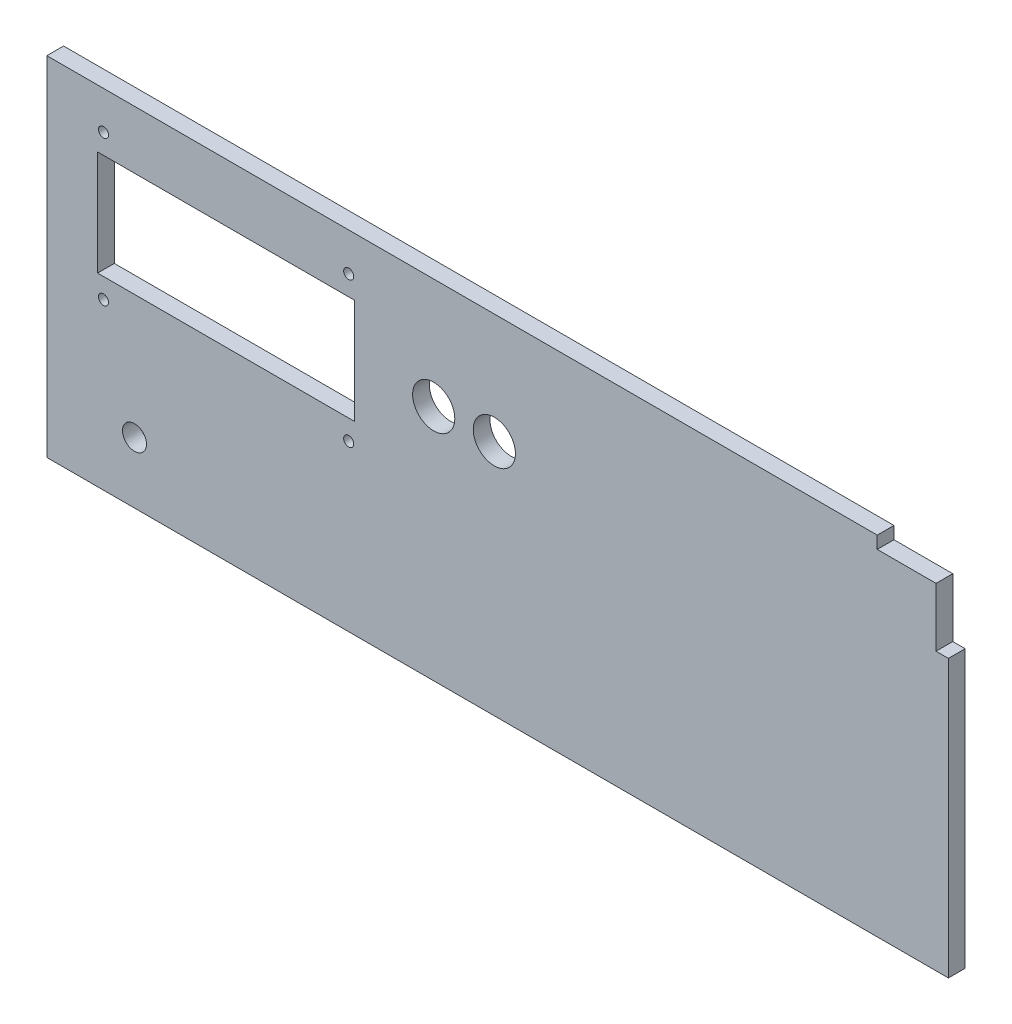
ISO-10303-21;
HEADER;
FILE_DESCRIPTION(('STEP AP214'),'2;1');
FILE_NAME('part.step','',(''),(''),'','','');
FILE_SCHEMA(('AUTOMOTIVE_DESIGN { 1 0 10303 214 1 1 1 1 }'));
ENDSEC;
DATA;
#1=APPLICATION_CONTEXT('core data for automotive mechanical design processes');
#2=APPLICATION_PROTOCOL_DEFINITION('international standard','automotive_design',2000,#1);
#3=PRODUCT_CONTEXT('',#1,'mechanical');
#4=PRODUCT('Part','Part','',(#3));
#5=PRODUCT_RELATED_PRODUCT_CATEGORY('part','',(#4));
#6=PRODUCT_DEFINITION_FORMATION('','',#4);
#7=PRODUCT_DEFINITION_CONTEXT('part definition',#1,'design');
#8=PRODUCT_DEFINITION('design','',#6,#7);
#9=PRODUCT_DEFINITION_SHAPE('','',#8);
#10=(LENGTH_UNIT() NAMED_UNIT(*) SI_UNIT(.MILLI.,.METRE.));
#11=(NAMED_UNIT(*) PLANE_ANGLE_UNIT() SI_UNIT($,.RADIAN.));
#12=(NAMED_UNIT(*) SI_UNIT($,.STERADIAN.) SOLID_ANGLE_UNIT());
#13=UNCERTAINTY_MEASURE_WITH_UNIT(LENGTH_MEASURE(1.E-05),#10,'distance_accuracy_value','');
#14=(GEOMETRIC_REPRESENTATION_CONTEXT(3) GLOBAL_UNCERTAINTY_ASSIGNED_CONTEXT((#13)) GLOBAL_UNIT_ASSIGNED_CONTEXT((#10,
#11,#12)) REPRESENTATION_CONTEXT('',''));
#15=CARTESIAN_POINT('',(0.,0.,0.));
#16=DIRECTION('',(0.,0.,1.));
#17=DIRECTION('',(1.,0.,0.));
#18=AXIS2_PLACEMENT_3D('',#15,#16,#17);
#19=CARTESIAN_POINT('',(0.,0.,6.35));
#20=DIRECTION('',(0.,0.,-1.));
#21=DIRECTION('',(-1.,0.,0.));
#22=AXIS2_PLACEMENT_3D('',#19,#20,#21);
#23=PLANE('',#22);
#24=CARTESIAN_POINT('',(146.75,90.1,6.35));
#25=DIRECTION('',(0.,0.,1.));
#26=DIRECTION('',(1.,0.,0.));
#27=AXIS2_PLACEMENT_3D('',#24,#25,#26);
#28=CIRCLE('',#27,8.00000000000001);
#29=CARTESIAN_POINT('',(154.75,90.1,6.35));
#30=VERTEX_POINT('',#29);
#31=EDGE_CURVE('E161',#30,#30,#28,.T.);
#32=ORIENTED_EDGE('',*,*,#31,.F.);
#33=EDGE_LOOP('',(#32));
#34=FACE_BOUND('',#33,.T.);
#35=CARTESIAN_POINT('',(169.75,90.1,6.35));
#36=DIRECTION('',(0.,0.,1.));
#37=DIRECTION('',(1.,0.,0.));
#38=AXIS2_PLACEMENT_3D('',#35,#36,#37);
#39=CIRCLE('',#38,8.00000000000001);
#40=CARTESIAN_POINT('',(177.75,90.1,6.35));
#41=VERTEX_POINT('',#40);
#42=EDGE_CURVE('E167',#41,#41,#39,.T.);
#43=ORIENTED_EDGE('',*,*,#42,.F.);
#44=EDGE_LOOP('',(#43));
#45=FACE_BOUND('',#44,.T.);
#46=CARTESIAN_POINT('',(21.4999951210496,117.600002885401,6.35));
#47=DIRECTION('',(0.,0.,1.));
#48=DIRECTION('',(1.,0.,0.));
#49=AXIS2_PLACEMENT_3D('',#46,#47,#48);
#50=CIRCLE('',#49,1.9);
#51=CARTESIAN_POINT('',(23.3999951210496,117.600002885401,6.35));
#52=VERTEX_POINT('',#51);
#53=EDGE_CURVE('E173',#52,#52,#50,.T.);
#54=ORIENTED_EDGE('',*,*,#53,.F.);
#55=EDGE_LOOP('',(#54));
#56=FACE_BOUND('',#55,.T.);
#57=CARTESIAN_POINT('',(21.4999951210496,62.6,6.35));
#58=DIRECTION('',(0.,0.,1.));
#59=DIRECTION('',(1.,0.,0.));
#60=AXIS2_PLACEMENT_3D('',#57,#58,#59);
#61=CIRCLE('',#60,1.9);
#62=CARTESIAN_POINT('',(23.3999951210496,62.6,6.35));
#63=VERTEX_POINT('',#62);
#64=EDGE_CURVE('E179',#63,#63,#61,.T.);
#65=ORIENTED_EDGE('',*,*,#64,.F.);
#66=EDGE_LOOP('',(#65));
#67=FACE_BOUND('',#66,.T.);
#68=CARTESIAN_POINT('',(114.49999512105,62.6,6.35));
#69=DIRECTION('',(0.,0.,1.));
#70=DIRECTION('',(1.,0.,0.));
#71=AXIS2_PLACEMENT_3D('',#68,#69,#70);
#72=CIRCLE('',#71,1.9);
#73=CARTESIAN_POINT('',(116.39999512105,62.6,6.35));
#74=VERTEX_POINT('',#73);
#75=EDGE_CURVE('E185',#74,#74,#72,.T.);
#76=ORIENTED_EDGE('',*,*,#75,.F.);
#77=EDGE_LOOP('',(#76));
#78=FACE_BOUND('',#77,.T.);
#79=CARTESIAN_POINT('',(114.49999512105,117.600002885401,6.35));
#80=DIRECTION('',(0.,0.,1.));
#81=DIRECTION('',(1.,0.,0.));
#82=AXIS2_PLACEMENT_3D('',#79,#80,#81);
#83=CIRCLE('',#82,1.9);
#84=CARTESIAN_POINT('',(116.39999512105,117.600002885401,6.35));
#85=VERTEX_POINT('',#84);
#86=EDGE_CURVE('E191',#85,#85,#83,.T.);
#87=ORIENTED_EDGE('',*,*,#86,.F.);
#88=EDGE_LOOP('',(#87));
#89=FACE_BOUND('',#88,.T.);
#90=DIRECTION('',(0.,-1.,0.));
#91=VECTOR('',#90,1.);
#92=CARTESIAN_POINT('',(0.,0.,6.35));
#93=LINE('',#92,#91);
#94=CARTESIAN_POINT('',(0.,132.,6.35));
#95=VERTEX_POINT('',#94);
#96=CARTESIAN_POINT('',(0.,0.,6.35));
#97=VERTEX_POINT('',#96);
#98=EDGE_CURVE('E197',#95,#97,#93,.T.);
#99=ORIENTED_EDGE('',*,*,#98,.T.);
#100=DIRECTION('',(1.,0.,0.));
#101=VECTOR('',#100,1.);
#102=CARTESIAN_POINT('',(0.,0.,6.35));
#103=LINE('',#102,#101);
#104=CARTESIAN_POINT('',(342.,0.,6.35));
#105=VERTEX_POINT('',#104);
#106=EDGE_CURVE('E200',#97,#105,#103,.T.);
#107=ORIENTED_EDGE('',*,*,#106,.T.);
#108=DIRECTION('',(0.,1.,0.));
#109=VECTOR('',#108,1.);
#110=CARTESIAN_POINT('',(342.,0.,6.35));
#111=LINE('',#110,#109);
#112=CARTESIAN_POINT('',(342.,105.,6.35));
#113=VERTEX_POINT('',#112);
#114=EDGE_CURVE('E203',#105,#113,#111,.T.);
#115=ORIENTED_EDGE('',*,*,#114,.T.);
#116=DIRECTION('',(-1.,0.,0.));
#117=VECTOR('',#116,1.);
#118=CARTESIAN_POINT('',(337.3,105.,6.35));
#119=LINE('',#118,#117);
#120=CARTESIAN_POINT('',(337.3,105.,6.35));
#121=VERTEX_POINT('',#120);
#122=EDGE_CURVE('E205',#113,#121,#119,.T.);
#123=ORIENTED_EDGE('',*,*,#122,.T.);
#124=DIRECTION('',(0.,1.,0.));
#125=VECTOR('',#124,1.);
#126=CARTESIAN_POINT('',(337.3,127.3,6.35));
#127=LINE('',#126,#125);
#128=CARTESIAN_POINT('',(337.3,127.3,6.35));
#129=VERTEX_POINT('',#128);
#130=EDGE_CURVE('E207',#121,#129,#127,.T.);
#131=ORIENTED_EDGE('',*,*,#130,.T.);
#132=DIRECTION('',(-1.,0.,0.));
#133=VECTOR('',#132,1.);
#134=CARTESIAN_POINT('',(315.,127.3,6.35));
#135=LINE('',#134,#133);
#136=CARTESIAN_POINT('',(315.,127.3,6.35));
#137=VERTEX_POINT('',#136);
#138=EDGE_CURVE('E209',#129,#137,#135,.T.);
#139=ORIENTED_EDGE('',*,*,#138,.T.);
#140=DIRECTION('',(0.,1.,0.));
#141=VECTOR('',#140,1.);
#142=CARTESIAN_POINT('',(315.,132.,6.35));
#143=LINE('',#142,#141);
#144=CARTESIAN_POINT('',(315.,132.,6.35));
#145=VERTEX_POINT('',#144);
#146=EDGE_CURVE('E211',#137,#145,#143,.T.);
#147=ORIENTED_EDGE('',*,*,#146,.T.);
#148=DIRECTION('',(-1.,0.,0.));
#149=VECTOR('',#148,1.);
#150=CARTESIAN_POINT('',(0.,132.,6.35));
#151=LINE('',#150,#149);
#152=EDGE_CURVE('E213',#145,#95,#151,.T.);
#153=ORIENTED_EDGE('',*,*,#152,.T.);
#154=EDGE_LOOP('',(#99,#107,#115,#123,#131,#139,#147,#153));
#155=FACE_BOUND('',#154,.T.);
#156=DIRECTION('',(0.,1.,0.));
#157=VECTOR('',#156,1.);
#158=CARTESIAN_POINT('',(116.75,70.2,6.35));
#159=LINE('',#158,#157);
#160=CARTESIAN_POINT('',(116.75,70.2,6.35));
#161=VERTEX_POINT('',#160);
#162=CARTESIAN_POINT('',(116.75,110.,6.35));
#163=VERTEX_POINT('',#162);
#164=EDGE_CURVE('E122',#161,#163,#159,.T.);
#165=ORIENTED_EDGE('',*,*,#164,.F.);
#166=DIRECTION('',(1.,0.,0.));
#167=VECTOR('',#166,1.);
#168=CARTESIAN_POINT('',(19.25,70.2,6.35));
#169=LINE('',#168,#167);
#170=CARTESIAN_POINT('',(19.25,70.2,6.35));
#171=VERTEX_POINT('',#170);
#172=EDGE_CURVE('E145',#171,#161,#169,.T.);
#173=ORIENTED_EDGE('',*,*,#172,.F.);
#174=DIRECTION('',(0.,-1.,0.));
#175=VECTOR('',#174,1.);
#176=CARTESIAN_POINT('',(19.25,70.2,6.35));
#177=LINE('',#176,#175);
#178=CARTESIAN_POINT('',(19.25,110.,6.35));
#179=VERTEX_POINT('',#178);
#180=EDGE_CURVE('E143',#179,#171,#177,.T.);
#181=ORIENTED_EDGE('',*,*,#180,.F.);
#182=DIRECTION('',(-1.,0.,0.));
#183=VECTOR('',#182,1.);
#184=CARTESIAN_POINT('',(19.25,110.,6.35));
#185=LINE('',#184,#183);
#186=EDGE_CURVE('E130',#163,#179,#185,.T.);
#187=ORIENTED_EDGE('',*,*,#186,.F.);
#188=EDGE_LOOP('',(#165,#173,#181,#187));
#189=FACE_BOUND('',#188,.T.);
#190=CARTESIAN_POINT('',(33.25,23.2,6.35));
#191=DIRECTION('',(0.,0.,1.));
#192=DIRECTION('',(1.,0.,0.));
#193=AXIS2_PLACEMENT_3D('',#190,#191,#192);
#194=CIRCLE('',#193,4.55000000000001);
#195=CARTESIAN_POINT('',(37.8,23.2,6.35));
#196=VERTEX_POINT('',#195);
#197=EDGE_CURVE('E151',#196,#196,#194,.T.);
#198=ORIENTED_EDGE('',*,*,#197,.F.);
#199=EDGE_LOOP('',(#198));
#200=FACE_BOUND('',#199,.T.);
#201=ADVANCED_FACE('F33',(#34,#45,#56,#67,#78,#89,#155,#189,#200),#23,.F.);
#202=CARTESIAN_POINT('',(0.,0.,0.));
#203=DIRECTION('',(0.,0.,-1.));
#204=DIRECTION('',(-1.,0.,0.));
#205=AXIS2_PLACEMENT_3D('',#202,#203,#204);
#206=PLANE('',#205);
#207=DIRECTION('',(1.,0.,0.));
#208=VECTOR('',#207,1.);
#209=CARTESIAN_POINT('',(19.25,70.2,0.));
#210=LINE('',#209,#208);
#211=CARTESIAN_POINT('',(19.25,70.2,0.));
#212=VERTEX_POINT('',#211);
#213=CARTESIAN_POINT('',(116.75,70.2,0.));
#214=VERTEX_POINT('',#213);
#215=EDGE_CURVE('E131',#212,#214,#210,.T.);
#216=ORIENTED_EDGE('',*,*,#215,.T.);
#217=DIRECTION('',(0.,1.,0.));
#218=VECTOR('',#217,1.);
#219=CARTESIAN_POINT('',(116.75,70.2,0.));
#220=LINE('',#219,#218);
#221=CARTESIAN_POINT('',(116.75,110.,0.));
#222=VERTEX_POINT('',#221);
#223=EDGE_CURVE('E56',#214,#222,#220,.T.);
#224=ORIENTED_EDGE('',*,*,#223,.T.);
#225=DIRECTION('',(-1.,0.,0.));
#226=VECTOR('',#225,1.);
#227=CARTESIAN_POINT('',(19.25,110.,0.));
#228=LINE('',#227,#226);
#229=CARTESIAN_POINT('',(19.25,110.,0.));
#230=VERTEX_POINT('',#229);
#231=EDGE_CURVE('E137',#222,#230,#228,.T.);
#232=ORIENTED_EDGE('',*,*,#231,.T.);
#233=DIRECTION('',(0.,-1.,0.));
#234=VECTOR('',#233,1.);
#235=CARTESIAN_POINT('',(19.25,70.2,0.));
#236=LINE('',#235,#234);
#237=EDGE_CURVE('E153',#230,#212,#236,.T.);
#238=ORIENTED_EDGE('',*,*,#237,.T.);
#239=EDGE_LOOP('',(#216,#224,#232,#238));
#240=FACE_BOUND('',#239,.T.);
#241=CARTESIAN_POINT('',(146.75,90.1,0.));
#242=DIRECTION('',(0.,0.,1.));
#243=DIRECTION('',(1.,0.,0.));
#244=AXIS2_PLACEMENT_3D('',#241,#242,#243);
#245=CIRCLE('',#244,8.00000000000001);
#246=CARTESIAN_POINT('',(154.75,90.1,0.));
#247=VERTEX_POINT('',#246);
#248=EDGE_CURVE('E138',#247,#247,#245,.T.);
#249=ORIENTED_EDGE('',*,*,#248,.T.);
#250=EDGE_LOOP('',(#249));
#251=FACE_BOUND('',#250,.T.);
#252=CARTESIAN_POINT('',(21.4999951210496,117.600002885401,0.));
#253=DIRECTION('',(0.,0.,1.));
#254=DIRECTION('',(1.,0.,0.));
#255=AXIS2_PLACEMENT_3D('',#252,#253,#254);
#256=CIRCLE('',#255,1.9);
#257=CARTESIAN_POINT('',(23.3999951210496,117.600002885401,0.));
#258=VERTEX_POINT('',#257);
#259=EDGE_CURVE('E170',#258,#258,#256,.T.);
#260=ORIENTED_EDGE('',*,*,#259,.T.);
#261=EDGE_LOOP('',(#260));
#262=FACE_BOUND('',#261,.T.);
#263=CARTESIAN_POINT('',(114.49999512105,62.6,0.));
#264=DIRECTION('',(0.,0.,1.));
#265=DIRECTION('',(1.,0.,0.));
#266=AXIS2_PLACEMENT_3D('',#263,#264,#265);
#267=CIRCLE('',#266,1.9);
#268=CARTESIAN_POINT('',(116.39999512105,62.6,0.));
#269=VERTEX_POINT('',#268);
#270=EDGE_CURVE('E182',#269,#269,#267,.T.);
#271=ORIENTED_EDGE('',*,*,#270,.T.);
#272=EDGE_LOOP('',(#271));
#273=FACE_BOUND('',#272,.T.);
#274=DIRECTION('',(0.,-1.,0.));
#275=VECTOR('',#274,1.);
#276=CARTESIAN_POINT('',(0.,0.,0.));
#277=LINE('',#276,#275);
#278=CARTESIAN_POINT('',(0.,132.,0.));
#279=VERTEX_POINT('',#278);
#280=CARTESIAN_POINT('',(0.,0.,0.));
#281=VERTEX_POINT('',#280);
#282=EDGE_CURVE('E194',#279,#281,#277,.T.);
#283=ORIENTED_EDGE('',*,*,#282,.F.);
#284=DIRECTION('',(-1.,0.,0.));
#285=VECTOR('',#284,1.);
#286=CARTESIAN_POINT('',(0.,132.,0.));
#287=LINE('',#286,#285);
#288=CARTESIAN_POINT('',(315.,132.,0.));
#289=VERTEX_POINT('',#288);
#290=EDGE_CURVE('E201',#289,#279,#287,.T.);
#291=ORIENTED_EDGE('',*,*,#290,.F.);
#292=DIRECTION('',(0.,1.,0.));
#293=VECTOR('',#292,1.);
#294=CARTESIAN_POINT('',(315.,132.,0.));
#295=LINE('',#294,#293);
#296=CARTESIAN_POINT('',(315.,127.3,0.));
#297=VERTEX_POINT('',#296);
#298=EDGE_CURVE('E228',#297,#289,#295,.T.);
#299=ORIENTED_EDGE('',*,*,#298,.F.);
#300=DIRECTION('',(-1.,0.,0.));
#301=VECTOR('',#300,1.);
#302=CARTESIAN_POINT('',(315.,127.3,0.));
#303=LINE('',#302,#301);
#304=CARTESIAN_POINT('',(337.3,127.3,0.));
#305=VERTEX_POINT('',#304);
#306=EDGE_CURVE('E226',#305,#297,#303,.T.);
#307=ORIENTED_EDGE('',*,*,#306,.F.);
#308=DIRECTION('',(0.,1.,0.));
#309=VECTOR('',#308,1.);
#310=CARTESIAN_POINT('',(337.3,127.3,0.));
#311=LINE('',#310,#309);
#312=CARTESIAN_POINT('',(337.3,105.,0.));
#313=VERTEX_POINT('',#312);
#314=EDGE_CURVE('E224',#313,#305,#311,.T.);
#315=ORIENTED_EDGE('',*,*,#314,.F.);
#316=DIRECTION('',(-1.,0.,0.));
#317=VECTOR('',#316,1.);
#318=CARTESIAN_POINT('',(337.3,105.,0.));
#319=LINE('',#318,#317);
#320=CARTESIAN_POINT('',(342.,105.,0.));
#321=VERTEX_POINT('',#320);
#322=EDGE_CURVE('E222',#321,#313,#319,.T.);
#323=ORIENTED_EDGE('',*,*,#322,.F.);
#324=DIRECTION('',(0.,1.,0.));
#325=VECTOR('',#324,1.);
#326=CARTESIAN_POINT('',(342.,0.,0.));
#327=LINE('',#326,#325);
#328=CARTESIAN_POINT('',(342.,0.,0.));
#329=VERTEX_POINT('',#328);
#330=EDGE_CURVE('E220',#329,#321,#327,.T.);
#331=ORIENTED_EDGE('',*,*,#330,.F.);
#332=DIRECTION('',(1.,0.,0.));
#333=VECTOR('',#332,1.);
#334=CARTESIAN_POINT('',(0.,0.,0.));
#335=LINE('',#334,#333);
#336=EDGE_CURVE('E218',#281,#329,#335,.T.);
#337=ORIENTED_EDGE('',*,*,#336,.F.);
#338=EDGE_LOOP('',(#283,#291,#299,#307,#315,#323,#331,#337));
#339=FACE_BOUND('',#338,.T.);
#340=CARTESIAN_POINT('',(114.49999512105,117.600002885401,0.));
#341=DIRECTION('',(0.,0.,1.));
#342=DIRECTION('',(1.,0.,0.));
#343=AXIS2_PLACEMENT_3D('',#340,#341,#342);
#344=CIRCLE('',#343,1.9);
#345=CARTESIAN_POINT('',(116.39999512105,117.600002885401,0.));
#346=VERTEX_POINT('',#345);
#347=EDGE_CURVE('E188',#346,#346,#344,.T.);
#348=ORIENTED_EDGE('',*,*,#347,.T.);
#349=EDGE_LOOP('',(#348));
#350=FACE_BOUND('',#349,.T.);
#351=CARTESIAN_POINT('',(21.4999951210496,62.6,0.));
#352=DIRECTION('',(0.,0.,1.));
#353=DIRECTION('',(1.,0.,0.));
#354=AXIS2_PLACEMENT_3D('',#351,#352,#353);
#355=CIRCLE('',#354,1.9);
#356=CARTESIAN_POINT('',(23.3999951210496,62.6,0.));
#357=VERTEX_POINT('',#356);
#358=EDGE_CURVE('E176',#357,#357,#355,.T.);
#359=ORIENTED_EDGE('',*,*,#358,.T.);
#360=EDGE_LOOP('',(#359));
#361=FACE_BOUND('',#360,.T.);
#362=CARTESIAN_POINT('',(169.75,90.1,0.));
#363=DIRECTION('',(0.,0.,1.));
#364=DIRECTION('',(1.,0.,0.));
#365=AXIS2_PLACEMENT_3D('',#362,#363,#364);
#366=CIRCLE('',#365,8.00000000000001);
#367=CARTESIAN_POINT('',(177.75,90.1,0.));
#368=VERTEX_POINT('',#367);
#369=EDGE_CURVE('E164',#368,#368,#366,.T.);
#370=ORIENTED_EDGE('',*,*,#369,.T.);
#371=EDGE_LOOP('',(#370));
#372=FACE_BOUND('',#371,.T.);
#373=CARTESIAN_POINT('',(33.25,23.2,0.));
#374=DIRECTION('',(0.,0.,1.));
#375=DIRECTION('',(1.,0.,0.));
#376=AXIS2_PLACEMENT_3D('',#373,#374,#375);
#377=CIRCLE('',#376,4.55000000000001);
#378=CARTESIAN_POINT('',(37.8,23.2,0.));
#379=VERTEX_POINT('',#378);
#380=EDGE_CURVE('E332',#379,#379,#377,.T.);
#381=ORIENTED_EDGE('',*,*,#380,.T.);
#382=EDGE_LOOP('',(#381));
#383=FACE_BOUND('',#382,.T.);
#384=ADVANCED_FACE('F258',(#240,#251,#262,#273,#339,#350,#361,#372,#383),#206,.T.);
#385=CARTESIAN_POINT('',(0.,0.,6.35));
#386=DIRECTION('',(1.,0.,0.));
#387=DIRECTION('',(0.,0.,-1.));
#388=AXIS2_PLACEMENT_3D('',#385,#386,#387);
#389=PLANE('',#388);
#390=ORIENTED_EDGE('',*,*,#282,.T.);
#391=DIRECTION('',(0.,0.,-1.));
#392=VECTOR('',#391,1.);
#393=CARTESIAN_POINT('',(0.,0.,6.35));
#394=LINE('',#393,#392);
#395=EDGE_CURVE('E11',#97,#281,#394,.T.);
#396=ORIENTED_EDGE('',*,*,#395,.F.);
#397=ORIENTED_EDGE('',*,*,#98,.F.);
#398=DIRECTION('',(0.,0.,-1.));
#399=VECTOR('',#398,1.);
#400=CARTESIAN_POINT('',(0.,132.,6.35));
#401=LINE('',#400,#399);
#402=EDGE_CURVE('E215',#95,#279,#401,.T.);
#403=ORIENTED_EDGE('',*,*,#402,.T.);
#404=EDGE_LOOP('',(#390,#396,#397,#403));
#405=FACE_BOUND('',#404,.T.);
#406=ADVANCED_FACE('F35',(#405),#389,.F.);
#407=CARTESIAN_POINT('',(0.,0.,6.35));
#408=DIRECTION('',(0.,1.,0.));
#409=DIRECTION('',(0.,0.,1.));
#410=AXIS2_PLACEMENT_3D('',#407,#408,#409);
#411=PLANE('',#410);
#412=ORIENTED_EDGE('',*,*,#336,.T.);
#413=DIRECTION('',(0.,0.,-1.));
#414=VECTOR('',#413,1.);
#415=CARTESIAN_POINT('',(342.,0.,6.35));
#416=LINE('',#415,#414);
#417=EDGE_CURVE('E41',#105,#329,#416,.T.);
#418=ORIENTED_EDGE('',*,*,#417,.F.);
#419=ORIENTED_EDGE('',*,*,#106,.F.);
#420=ORIENTED_EDGE('',*,*,#395,.T.);
#421=EDGE_LOOP('',(#412,#418,#419,#420));
#422=FACE_BOUND('',#421,.T.);
#423=ADVANCED_FACE('F275',(#422),#411,.F.);
#424=CARTESIAN_POINT('',(342.,0.,6.35));
#425=DIRECTION('',(-1.,0.,0.));
#426=DIRECTION('',(0.,-1.,0.));
#427=AXIS2_PLACEMENT_3D('',#424,#425,#426);
#428=PLANE('',#427);
#429=ORIENTED_EDGE('',*,*,#330,.T.);
#430=DIRECTION('',(0.,0.,-1.));
#431=VECTOR('',#430,1.);
#432=CARTESIAN_POINT('',(342.,105.,6.35));
#433=LINE('',#432,#431);
#434=EDGE_CURVE('E245',#113,#321,#433,.T.);
#435=ORIENTED_EDGE('',*,*,#434,.F.);
#436=ORIENTED_EDGE('',*,*,#114,.F.);
#437=ORIENTED_EDGE('',*,*,#417,.T.);
#438=EDGE_LOOP('',(#429,#435,#436,#437));
#439=FACE_BOUND('',#438,.T.);
#440=ADVANCED_FACE('F252',(#439),#428,.F.);
#441=CARTESIAN_POINT('',(337.3,105.,6.35));
#442=DIRECTION('',(0.,-1.,0.));
#443=DIRECTION('',(0.,0.,-1.));
#444=AXIS2_PLACEMENT_3D('',#441,#442,#443);
#445=PLANE('',#444);
#446=ORIENTED_EDGE('',*,*,#322,.T.);
#447=DIRECTION('',(0.,0.,-1.));
#448=VECTOR('',#447,1.);
#449=CARTESIAN_POINT('',(337.3,105.,6.35));
#450=LINE('',#449,#448);
#451=EDGE_CURVE('E242',#121,#313,#450,.T.);
#452=ORIENTED_EDGE('',*,*,#451,.F.);
#453=ORIENTED_EDGE('',*,*,#122,.F.);
#454=ORIENTED_EDGE('',*,*,#434,.T.);
#455=EDGE_LOOP('',(#446,#452,#453,#454));
#456=FACE_BOUND('',#455,.T.);
#457=ADVANCED_FACE('F264',(#456),#445,.F.);
#458=CARTESIAN_POINT('',(337.3,127.3,6.35));
#459=DIRECTION('',(-1.,0.,0.));
#460=DIRECTION('',(0.,0.,1.));
#461=AXIS2_PLACEMENT_3D('',#458,#459,#460);
#462=PLANE('',#461);
#463=ORIENTED_EDGE('',*,*,#314,.T.);
#464=DIRECTION('',(0.,0.,-1.));
#465=VECTOR('',#464,1.);
#466=CARTESIAN_POINT('',(337.3,127.3,6.35));
#467=LINE('',#466,#465);
#468=EDGE_CURVE('E239',#129,#305,#467,.T.);
#469=ORIENTED_EDGE('',*,*,#468,.F.);
#470=ORIENTED_EDGE('',*,*,#130,.F.);
#471=ORIENTED_EDGE('',*,*,#451,.T.);
#472=EDGE_LOOP('',(#463,#469,#470,#471));
#473=FACE_BOUND('',#472,.T.);
#474=ADVANCED_FACE('F268',(#473),#462,.F.);
#475=CARTESIAN_POINT('',(315.,127.3,6.35));
#476=DIRECTION('',(0.,-1.,0.));
#477=DIRECTION('',(0.,0.,-1.));
#478=AXIS2_PLACEMENT_3D('',#475,#476,#477);
#479=PLANE('',#478);
#480=ORIENTED_EDGE('',*,*,#306,.T.);
#481=DIRECTION('',(0.,0.,-1.));
#482=VECTOR('',#481,1.);
#483=CARTESIAN_POINT('',(315.,127.3,6.35));
#484=LINE('',#483,#482);
#485=EDGE_CURVE('E236',#137,#297,#484,.T.);
#486=ORIENTED_EDGE('',*,*,#485,.F.);
#487=ORIENTED_EDGE('',*,*,#138,.F.);
#488=ORIENTED_EDGE('',*,*,#468,.T.);
#489=EDGE_LOOP('',(#480,#486,#487,#488));
#490=FACE_BOUND('',#489,.T.);
#491=ADVANCED_FACE('F288',(#490),#479,.F.);
#492=CARTESIAN_POINT('',(315.,132.,6.35));
#493=DIRECTION('',(-1.,0.,0.));
#494=DIRECTION('',(0.,0.,1.));
#495=AXIS2_PLACEMENT_3D('',#492,#493,#494);
#496=PLANE('',#495);
#497=ORIENTED_EDGE('',*,*,#298,.T.);
#498=DIRECTION('',(0.,0.,-1.));
#499=VECTOR('',#498,1.);
#500=CARTESIAN_POINT('',(315.,132.,6.35));
#501=LINE('',#500,#499);
#502=EDGE_CURVE('E233',#145,#289,#501,.T.);
#503=ORIENTED_EDGE('',*,*,#502,.F.);
#504=ORIENTED_EDGE('',*,*,#146,.F.);
#505=ORIENTED_EDGE('',*,*,#485,.T.);
#506=EDGE_LOOP('',(#497,#503,#504,#505));
#507=FACE_BOUND('',#506,.T.);
#508=ADVANCED_FACE('F286',(#507),#496,.F.);
#509=CARTESIAN_POINT('',(0.,132.,6.35));
#510=DIRECTION('',(0.,-1.,0.));
#511=DIRECTION('',(0.,0.,-1.));
#512=AXIS2_PLACEMENT_3D('',#509,#510,#511);
#513=PLANE('',#512);
#514=ORIENTED_EDGE('',*,*,#290,.T.);
#515=ORIENTED_EDGE('',*,*,#402,.F.);
#516=ORIENTED_EDGE('',*,*,#152,.F.);
#517=ORIENTED_EDGE('',*,*,#502,.T.);
#518=EDGE_LOOP('',(#514,#515,#516,#517));
#519=FACE_BOUND('',#518,.T.);
#520=ADVANCED_FACE('F281',(#519),#513,.F.);
#521=CARTESIAN_POINT('',(114.49999512105,117.600002885401,6.35));
#522=DIRECTION('',(0.,0.,-1.));
#523=DIRECTION('',(-1.,0.,0.));
#524=AXIS2_PLACEMENT_3D('',#521,#522,#523);
#525=CYLINDRICAL_SURFACE('',#524,1.9);
#526=ORIENTED_EDGE('',*,*,#86,.T.);
#527=EDGE_LOOP('',(#526));
#528=FACE_BOUND('',#527,.T.);
#529=ORIENTED_EDGE('',*,*,#347,.F.);
#530=EDGE_LOOP('',(#529));
#531=FACE_BOUND('',#530,.T.);
#532=ADVANCED_FACE('F308',(#528,#531),#525,.F.);
#533=CARTESIAN_POINT('',(114.49999512105,62.6,6.35));
#534=DIRECTION('',(0.,0.,-1.));
#535=DIRECTION('',(-1.,0.,0.));
#536=AXIS2_PLACEMENT_3D('',#533,#534,#535);
#537=CYLINDRICAL_SURFACE('',#536,1.9);
#538=ORIENTED_EDGE('',*,*,#75,.T.);
#539=EDGE_LOOP('',(#538));
#540=FACE_BOUND('',#539,.T.);
#541=ORIENTED_EDGE('',*,*,#270,.F.);
#542=EDGE_LOOP('',(#541));
#543=FACE_BOUND('',#542,.T.);
#544=ADVANCED_FACE('F315',(#540,#543),#537,.F.);
#545=CARTESIAN_POINT('',(21.4999951210496,62.6,6.35));
#546=DIRECTION('',(0.,0.,-1.));
#547=DIRECTION('',(-1.,0.,0.));
#548=AXIS2_PLACEMENT_3D('',#545,#546,#547);
#549=CYLINDRICAL_SURFACE('',#548,1.9);
#550=ORIENTED_EDGE('',*,*,#64,.T.);
#551=EDGE_LOOP('',(#550));
#552=FACE_BOUND('',#551,.T.);
#553=ORIENTED_EDGE('',*,*,#358,.F.);
#554=EDGE_LOOP('',(#553));
#555=FACE_BOUND('',#554,.T.);
#556=ADVANCED_FACE('F320',(#552,#555),#549,.F.);
#557=CARTESIAN_POINT('',(21.4999951210496,117.600002885401,6.35));
#558=DIRECTION('',(0.,0.,-1.));
#559=DIRECTION('',(-1.,0.,0.));
#560=AXIS2_PLACEMENT_3D('',#557,#558,#559);
#561=CYLINDRICAL_SURFACE('',#560,1.9);
#562=ORIENTED_EDGE('',*,*,#53,.T.);
#563=EDGE_LOOP('',(#562));
#564=FACE_BOUND('',#563,.T.);
#565=ORIENTED_EDGE('',*,*,#259,.F.);
#566=EDGE_LOOP('',(#565));
#567=FACE_BOUND('',#566,.T.);
#568=ADVANCED_FACE('F362',(#564,#567),#561,.F.);
#569=CARTESIAN_POINT('',(169.75,90.1,6.35));
#570=DIRECTION('',(0.,0.,-1.));
#571=DIRECTION('',(-1.,0.,0.));
#572=AXIS2_PLACEMENT_3D('',#569,#570,#571);
#573=CYLINDRICAL_SURFACE('',#572,8.00000000000001);
#574=ORIENTED_EDGE('',*,*,#42,.T.);
#575=EDGE_LOOP('',(#574));
#576=FACE_BOUND('',#575,.T.);
#577=ORIENTED_EDGE('',*,*,#369,.F.);
#578=EDGE_LOOP('',(#577));
#579=FACE_BOUND('',#578,.T.);
#580=ADVANCED_FACE('F358',(#576,#579),#573,.F.);
#581=CARTESIAN_POINT('',(146.75,90.1,6.35));
#582=DIRECTION('',(0.,0.,-1.));
#583=DIRECTION('',(-1.,0.,0.));
#584=AXIS2_PLACEMENT_3D('',#581,#582,#583);
#585=CYLINDRICAL_SURFACE('',#584,8.00000000000001);
#586=ORIENTED_EDGE('',*,*,#31,.T.);
#587=EDGE_LOOP('',(#586));
#588=FACE_BOUND('',#587,.T.);
#589=ORIENTED_EDGE('',*,*,#248,.F.);
#590=EDGE_LOOP('',(#589));
#591=FACE_BOUND('',#590,.T.);
#592=ADVANCED_FACE('F355',(#588,#591),#585,.F.);
#593=CARTESIAN_POINT('',(116.75,70.2,6.35));
#594=DIRECTION('',(-1.,0.,0.));
#595=DIRECTION('',(0.,0.,1.));
#596=AXIS2_PLACEMENT_3D('',#593,#594,#595);
#597=PLANE('',#596);
#598=ORIENTED_EDGE('',*,*,#223,.F.);
#599=DIRECTION('',(0.,0.,-1.));
#600=VECTOR('',#599,1.);
#601=CARTESIAN_POINT('',(116.75,70.2,6.35));
#602=LINE('',#601,#600);
#603=EDGE_CURVE('E126',#161,#214,#602,.T.);
#604=ORIENTED_EDGE('',*,*,#603,.F.);
#605=ORIENTED_EDGE('',*,*,#164,.T.);
#606=DIRECTION('',(0.,0.,-1.));
#607=VECTOR('',#606,1.);
#608=CARTESIAN_POINT('',(116.75,110.,6.35));
#609=LINE('',#608,#607);
#610=EDGE_CURVE('E125',#163,#222,#609,.T.);
#611=ORIENTED_EDGE('',*,*,#610,.T.);
#612=EDGE_LOOP('',(#598,#604,#605,#611));
#613=FACE_BOUND('',#612,.T.);
#614=ADVANCED_FACE('F124',(#613),#597,.T.);
#615=CARTESIAN_POINT('',(19.25,110.,6.35));
#616=DIRECTION('',(0.,-1.,0.));
#617=DIRECTION('',(0.,0.,-1.));
#618=AXIS2_PLACEMENT_3D('',#615,#616,#617);
#619=PLANE('',#618);
#620=ORIENTED_EDGE('',*,*,#231,.F.);
#621=ORIENTED_EDGE('',*,*,#610,.F.);
#622=ORIENTED_EDGE('',*,*,#186,.T.);
#623=DIRECTION('',(0.,0.,-1.));
#624=VECTOR('',#623,1.);
#625=CARTESIAN_POINT('',(19.25,110.,6.35));
#626=LINE('',#625,#624);
#627=EDGE_CURVE('E139',#179,#230,#626,.T.);
#628=ORIENTED_EDGE('',*,*,#627,.T.);
#629=EDGE_LOOP('',(#620,#621,#622,#628));
#630=FACE_BOUND('',#629,.T.);
#631=ADVANCED_FACE('F134',(#630),#619,.T.);
#632=CARTESIAN_POINT('',(19.25,70.2,6.35));
#633=DIRECTION('',(1.,0.,0.));
#634=DIRECTION('',(0.,0.,-1.));
#635=AXIS2_PLACEMENT_3D('',#632,#633,#634);
#636=PLANE('',#635);
#637=ORIENTED_EDGE('',*,*,#237,.F.);
#638=ORIENTED_EDGE('',*,*,#627,.F.);
#639=ORIENTED_EDGE('',*,*,#180,.T.);
#640=DIRECTION('',(0.,0.,-1.));
#641=VECTOR('',#640,1.);
#642=CARTESIAN_POINT('',(19.25,70.2,6.35));
#643=LINE('',#642,#641);
#644=EDGE_CURVE('E48',#171,#212,#643,.T.);
#645=ORIENTED_EDGE('',*,*,#644,.T.);
#646=EDGE_LOOP('',(#637,#638,#639,#645));
#647=FACE_BOUND('',#646,.T.);
#648=ADVANCED_FACE('F345',(#647),#636,.T.);
#649=CARTESIAN_POINT('',(19.25,70.2,6.35));
#650=DIRECTION('',(0.,1.,0.));
#651=DIRECTION('',(0.,0.,1.));
#652=AXIS2_PLACEMENT_3D('',#649,#650,#651);
#653=PLANE('',#652);
#654=ORIENTED_EDGE('',*,*,#215,.F.);
#655=ORIENTED_EDGE('',*,*,#644,.F.);
#656=ORIENTED_EDGE('',*,*,#172,.T.);
#657=ORIENTED_EDGE('',*,*,#603,.T.);
#658=EDGE_LOOP('',(#654,#655,#656,#657));
#659=FACE_BOUND('',#658,.T.);
#660=ADVANCED_FACE('F340',(#659),#653,.T.);
#661=CARTESIAN_POINT('',(33.25,23.2,6.35));
#662=DIRECTION('',(0.,0.,-1.));
#663=DIRECTION('',(-1.,0.,0.));
#664=AXIS2_PLACEMENT_3D('',#661,#662,#663);
#665=CYLINDRICAL_SURFACE('',#664,4.55000000000001);
#666=ORIENTED_EDGE('',*,*,#197,.T.);
#667=EDGE_LOOP('',(#666));
#668=FACE_BOUND('',#667,.T.);
#669=ORIENTED_EDGE('',*,*,#380,.F.);
#670=EDGE_LOOP('',(#669));
#671=FACE_BOUND('',#670,.T.);
#672=ADVANCED_FACE('F338',(#668,#671),#665,.F.);
#673=CLOSED_SHELL('',(#201,#384,#406,#423,#440,#457,#474,#491,#508,#520,#532,#544,#556,#568,
#580,#592,#614,#631,#648,#660,#672));
#674=MANIFOLD_SOLID_BREP('B2',#673);
#675=ADVANCED_BREP_SHAPE_REPRESENTATION('',(#18,#674),#14);
#676=SHAPE_DEFINITION_REPRESENTATION(#9,#675);
ENDSEC;
END-ISO-10303-21;
